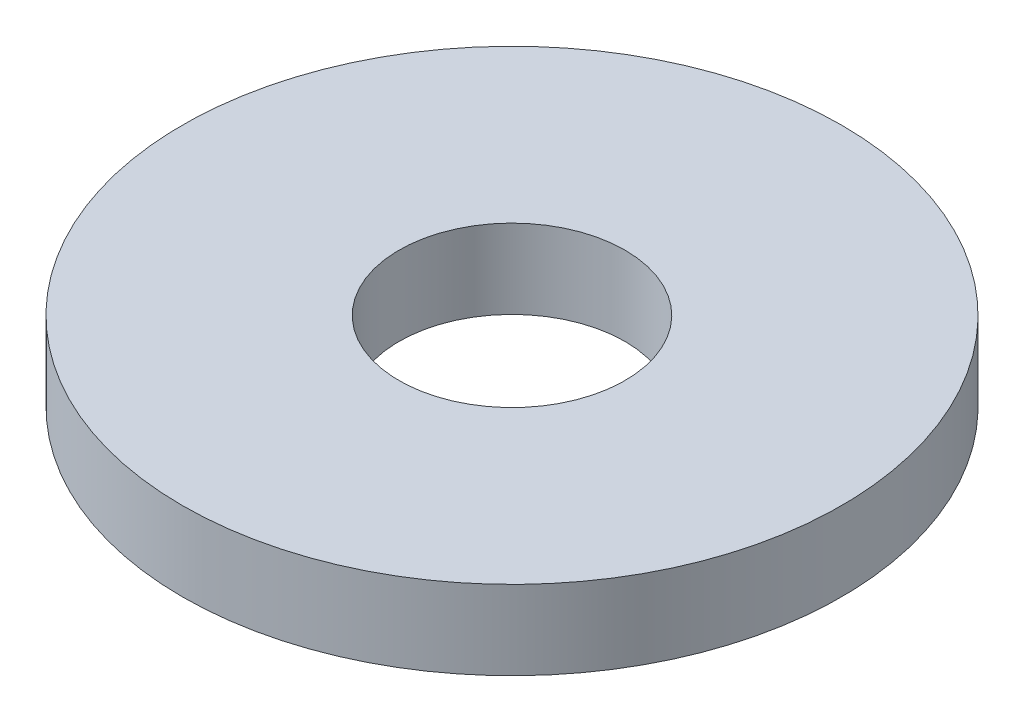
ISO-10303-21;
HEADER;
FILE_DESCRIPTION(('STEP AP214'),'2;1');
FILE_NAME('part.step','',(''),(''),'','','');
FILE_SCHEMA(('AUTOMOTIVE_DESIGN { 1 0 10303 214 1 1 1 1 }'));
ENDSEC;
DATA;
#1=APPLICATION_CONTEXT('core data for automotive mechanical design processes');
#2=APPLICATION_PROTOCOL_DEFINITION('international standard','automotive_design',2000,#1);
#3=PRODUCT_CONTEXT('',#1,'mechanical');
#4=PRODUCT('Part','Part','',(#3));
#5=PRODUCT_RELATED_PRODUCT_CATEGORY('part','',(#4));
#6=PRODUCT_DEFINITION_FORMATION('','',#4);
#7=PRODUCT_DEFINITION_CONTEXT('part definition',#1,'design');
#8=PRODUCT_DEFINITION('design','',#6,#7);
#9=PRODUCT_DEFINITION_SHAPE('','',#8);
#10=(LENGTH_UNIT() NAMED_UNIT(*) SI_UNIT(.MILLI.,.METRE.));
#11=(NAMED_UNIT(*) PLANE_ANGLE_UNIT() SI_UNIT($,.RADIAN.));
#12=(NAMED_UNIT(*) SI_UNIT($,.STERADIAN.) SOLID_ANGLE_UNIT());
#13=UNCERTAINTY_MEASURE_WITH_UNIT(LENGTH_MEASURE(1.E-05),#10,'distance_accuracy_value','');
#14=(GEOMETRIC_REPRESENTATION_CONTEXT(3) GLOBAL_UNCERTAINTY_ASSIGNED_CONTEXT((#13)) GLOBAL_UNIT_ASSIGNED_CONTEXT((#10,
#11,#12)) REPRESENTATION_CONTEXT('',''));
#15=CARTESIAN_POINT('',(0.,0.,0.));
#16=DIRECTION('',(0.,0.,1.));
#17=DIRECTION('',(1.,0.,0.));
#18=AXIS2_PLACEMENT_3D('',#15,#16,#17);
#19=CARTESIAN_POINT('',(0.,21.,0.));
#20=DIRECTION('',(0.,-1.,0.));
#21=DIRECTION('',(0.,0.,-1.));
#22=AXIS2_PLACEMENT_3D('',#19,#20,#21);
#23=CYLINDRICAL_SURFACE('',#22,87.5);
#24=CARTESIAN_POINT('',(0.,21.,0.));
#25=DIRECTION('',(0.,1.,0.));
#26=DIRECTION('',(0.,0.,1.));
#27=AXIS2_PLACEMENT_3D('',#24,#25,#26);
#28=CIRCLE('',#27,87.5);
#29=CARTESIAN_POINT('',(0.,21.,-87.5));
#30=VERTEX_POINT('',#29);
#31=EDGE_CURVE('E10',#30,#30,#28,.T.);
#32=CARTESIAN_POINT('',(0.,0.,0.));
#33=DIRECTION('',(0.,1.,0.));
#34=DIRECTION('',(0.,0.,1.));
#35=AXIS2_PLACEMENT_3D('',#32,#33,#34);
#36=CIRCLE('',#35,87.5);
#37=CARTESIAN_POINT('',(0.,0.,-87.5));
#38=VERTEX_POINT('',#37);
#39=EDGE_CURVE('E37',#38,#38,#36,.T.);
#40=CARTESIAN_POINT('',(0.,21.,-87.5));
#41=CARTESIAN_POINT('',(0.,20.78125,-87.5));
#42=CARTESIAN_POINT('',(0.,20.5625,-87.5));
#43=CARTESIAN_POINT('',(0.,20.125,-87.5));
#44=CARTESIAN_POINT('',(0.,19.90625,-87.5));
#45=CARTESIAN_POINT('',(0.,19.46875,-87.5));
#46=CARTESIAN_POINT('',(0.,19.25,-87.5));
#47=CARTESIAN_POINT('',(0.,18.8125,-87.5));
#48=CARTESIAN_POINT('',(0.,18.59375,-87.5));
#49=CARTESIAN_POINT('',(0.,18.15625,-87.5));
#50=CARTESIAN_POINT('',(0.,17.9375,-87.5));
#51=CARTESIAN_POINT('',(0.,17.5,-87.5));
#52=CARTESIAN_POINT('',(0.,17.28125,-87.5));
#53=CARTESIAN_POINT('',(0.,16.84375,-87.5));
#54=CARTESIAN_POINT('',(0.,16.625,-87.5));
#55=CARTESIAN_POINT('',(0.,16.1875,-87.5));
#56=CARTESIAN_POINT('',(0.,15.96875,-87.5));
#57=CARTESIAN_POINT('',(0.,15.53125,-87.5));
#58=CARTESIAN_POINT('',(0.,15.3125,-87.5));
#59=CARTESIAN_POINT('',(0.,14.875,-87.5));
#60=CARTESIAN_POINT('',(0.,14.65625,-87.5));
#61=CARTESIAN_POINT('',(0.,14.21875,-87.5));
#62=CARTESIAN_POINT('',(0.,14.,-87.5));
#63=CARTESIAN_POINT('',(0.,13.5625,-87.5));
#64=CARTESIAN_POINT('',(0.,13.34375,-87.5));
#65=CARTESIAN_POINT('',(0.,12.90625,-87.5));
#66=CARTESIAN_POINT('',(0.,12.6875,-87.5));
#67=CARTESIAN_POINT('',(0.,12.25,-87.5));
#68=CARTESIAN_POINT('',(0.,12.03125,-87.5));
#69=CARTESIAN_POINT('',(0.,11.59375,-87.5));
#70=CARTESIAN_POINT('',(0.,11.375,-87.5));
#71=CARTESIAN_POINT('',(0.,10.9375,-87.5));
#72=CARTESIAN_POINT('',(0.,10.71875,-87.5));
#73=CARTESIAN_POINT('',(0.,10.28125,-87.5));
#74=CARTESIAN_POINT('',(0.,10.0625,-87.5));
#75=CARTESIAN_POINT('',(0.,9.625,-87.5));
#76=CARTESIAN_POINT('',(0.,9.40625,-87.5));
#77=CARTESIAN_POINT('',(0.,8.96875,-87.5));
#78=CARTESIAN_POINT('',(0.,8.75,-87.5));
#79=CARTESIAN_POINT('',(0.,8.3125,-87.5));
#80=CARTESIAN_POINT('',(0.,8.09375,-87.5));
#81=CARTESIAN_POINT('',(0.,7.65625,-87.5));
#82=CARTESIAN_POINT('',(0.,7.4375,-87.5));
#83=CARTESIAN_POINT('',(0.,7.,-87.5));
#84=CARTESIAN_POINT('',(0.,6.78125,-87.5));
#85=CARTESIAN_POINT('',(0.,6.34375,-87.5));
#86=CARTESIAN_POINT('',(0.,6.125,-87.5));
#87=CARTESIAN_POINT('',(0.,5.6875,-87.5));
#88=CARTESIAN_POINT('',(0.,5.46875,-87.5));
#89=CARTESIAN_POINT('',(0.,5.03125,-87.5));
#90=CARTESIAN_POINT('',(0.,4.8125,-87.5));
#91=CARTESIAN_POINT('',(0.,4.375,-87.5));
#92=CARTESIAN_POINT('',(0.,4.15625,-87.5));
#93=CARTESIAN_POINT('',(0.,3.71875,-87.5));
#94=CARTESIAN_POINT('',(0.,3.5,-87.5));
#95=CARTESIAN_POINT('',(0.,3.0625,-87.5));
#96=CARTESIAN_POINT('',(0.,2.84375,-87.5));
#97=CARTESIAN_POINT('',(0.,2.40625,-87.5));
#98=CARTESIAN_POINT('',(0.,2.1875,-87.5));
#99=CARTESIAN_POINT('',(0.,1.75,-87.5));
#100=CARTESIAN_POINT('',(0.,1.53125,-87.5));
#101=CARTESIAN_POINT('',(0.,1.09375,-87.5));
#102=CARTESIAN_POINT('',(0.,0.875000000000001,-87.5));
#103=CARTESIAN_POINT('',(0.,0.4375,-87.5));
#104=CARTESIAN_POINT('',(0.,0.21875,-87.5));
#105=CARTESIAN_POINT('',(0.,0.,-87.5));
#106=B_SPLINE_CURVE_WITH_KNOTS('',3,(#40,#41,#42,#43,#44,#45,#46,#47,#48,#49,#50,#51,#52,#53,
#54,#55,#56,#57,#58,#59,#60,#61,#62,#63,#64,#65,#66,#67,#68,#69,#70,#71,#72,#73,#74,#75,#76,#77,
#78,#79,#80,#81,#82,#83,#84,#85,#86,#87,#88,#89,#90,#91,#92,#93,#94,#95,#96,#97,#98,#99,#100,
#101,#102,#103,#104,#105),.UNSPECIFIED.,.F.,.F.,(4,2,2,2,2,2,2,2,2,2,2,2,2,2,2,2,2,2,2,2,2,2,2,
2,2,2,2,2,2,2,2,2,4),(0.,0.656250000000001,1.3125,1.96875,2.625,3.28125,3.9375,4.59375,5.25,
5.90625,6.5625,7.21875,7.875,8.53125,9.1875,9.84375,10.5,11.15625,11.8125,12.46875,13.125,
13.78125,14.4375,15.09375,15.75,16.40625,17.0625,17.71875,18.375,19.03125,19.6875,20.34375,21.),.UNSPECIFIED.);
#107=EDGE_CURVE('BSEAM40',#30,#38,#106,.T.);
#108=ORIENTED_EDGE('',*,*,#31,.F.);
#109=ORIENTED_EDGE('',*,*,#39,.T.);
#110=ORIENTED_EDGE('',*,*,#107,.T.);
#111=ORIENTED_EDGE('',*,*,#107,.F.);
#112=EDGE_LOOP('',(#108,#110,#109,#111));
#113=FACE_BOUND('',#112,.T.);
#114=ADVANCED_FACE('F40',(#113),#23,.T.);
#115=CARTESIAN_POINT('',(0.,21.,0.));
#116=DIRECTION('',(0.,1.,0.));
#117=DIRECTION('',(0.,0.,1.));
#118=AXIS2_PLACEMENT_3D('',#115,#116,#117);
#119=PLANE('',#118);
#120=CARTESIAN_POINT('',(0.,21.,0.));
#121=DIRECTION('',(0.,1.,0.));
#122=DIRECTION('',(0.,0.,1.));
#123=AXIS2_PLACEMENT_3D('',#120,#121,#122);
#124=CIRCLE('',#123,30.);
#125=CARTESIAN_POINT('',(0.,21.,-30.));
#126=VERTEX_POINT('',#125);
#127=EDGE_CURVE('E50',#126,#126,#124,.T.);
#128=ORIENTED_EDGE('',*,*,#127,.F.);
#129=EDGE_LOOP('',(#128));
#130=FACE_BOUND('',#129,.T.);
#131=ORIENTED_EDGE('',*,*,#31,.T.);
#132=EDGE_LOOP('',(#131));
#133=FACE_BOUND('',#132,.T.);
#134=ADVANCED_FACE('F59',(#130,#133),#119,.T.);
#135=CARTESIAN_POINT('',(0.,0.,0.));
#136=DIRECTION('',(0.,1.,0.));
#137=DIRECTION('',(0.,0.,1.));
#138=AXIS2_PLACEMENT_3D('',#135,#136,#137);
#139=PLANE('',#138);
#140=CARTESIAN_POINT('',(0.,0.,0.));
#141=DIRECTION('',(0.,1.,0.));
#142=DIRECTION('',(0.,0.,1.));
#143=AXIS2_PLACEMENT_3D('',#140,#141,#142);
#144=CIRCLE('',#143,30.);
#145=CARTESIAN_POINT('',(0.,0.,-30.));
#146=VERTEX_POINT('',#145);
#147=EDGE_CURVE('E47',#146,#146,#144,.T.);
#148=ORIENTED_EDGE('',*,*,#147,.T.);
#149=EDGE_LOOP('',(#148));
#150=FACE_BOUND('',#149,.T.);
#151=ORIENTED_EDGE('',*,*,#39,.F.);
#152=EDGE_LOOP('',(#151));
#153=FACE_BOUND('',#152,.T.);
#154=ADVANCED_FACE('F58',(#150,#153),#139,.F.);
#155=CARTESIAN_POINT('',(0.,21.,0.));
#156=DIRECTION('',(0.,-1.,0.));
#157=DIRECTION('',(0.,0.,-1.));
#158=AXIS2_PLACEMENT_3D('',#155,#156,#157);
#159=CYLINDRICAL_SURFACE('',#158,30.);
#160=CARTESIAN_POINT('',(0.,21.,-30.));
#161=CARTESIAN_POINT('',(0.,20.78125,-30.));
#162=CARTESIAN_POINT('',(0.,20.5625,-30.));
#163=CARTESIAN_POINT('',(0.,20.125,-30.));
#164=CARTESIAN_POINT('',(0.,19.90625,-30.));
#165=CARTESIAN_POINT('',(0.,19.46875,-30.));
#166=CARTESIAN_POINT('',(0.,19.25,-30.));
#167=CARTESIAN_POINT('',(0.,18.8125,-30.));
#168=CARTESIAN_POINT('',(0.,18.59375,-30.));
#169=CARTESIAN_POINT('',(0.,18.15625,-30.));
#170=CARTESIAN_POINT('',(0.,17.9375,-30.));
#171=CARTESIAN_POINT('',(0.,17.5,-30.));
#172=CARTESIAN_POINT('',(0.,17.28125,-30.));
#173=CARTESIAN_POINT('',(0.,16.84375,-30.));
#174=CARTESIAN_POINT('',(0.,16.625,-30.));
#175=CARTESIAN_POINT('',(0.,16.1875,-30.));
#176=CARTESIAN_POINT('',(0.,15.96875,-30.));
#177=CARTESIAN_POINT('',(0.,15.53125,-30.));
#178=CARTESIAN_POINT('',(0.,15.3125,-30.));
#179=CARTESIAN_POINT('',(0.,14.875,-30.));
#180=CARTESIAN_POINT('',(0.,14.65625,-30.));
#181=CARTESIAN_POINT('',(0.,14.21875,-30.));
#182=CARTESIAN_POINT('',(0.,14.,-30.));
#183=CARTESIAN_POINT('',(0.,13.5625,-30.));
#184=CARTESIAN_POINT('',(0.,13.34375,-30.));
#185=CARTESIAN_POINT('',(0.,12.90625,-30.));
#186=CARTESIAN_POINT('',(0.,12.6875,-30.));
#187=CARTESIAN_POINT('',(0.,12.25,-30.));
#188=CARTESIAN_POINT('',(0.,12.03125,-30.));
#189=CARTESIAN_POINT('',(0.,11.59375,-30.));
#190=CARTESIAN_POINT('',(0.,11.375,-30.));
#191=CARTESIAN_POINT('',(0.,10.9375,-30.));
#192=CARTESIAN_POINT('',(0.,10.71875,-30.));
#193=CARTESIAN_POINT('',(0.,10.28125,-30.));
#194=CARTESIAN_POINT('',(0.,10.0625,-30.));
#195=CARTESIAN_POINT('',(0.,9.625,-30.));
#196=CARTESIAN_POINT('',(0.,9.40625,-30.));
#197=CARTESIAN_POINT('',(0.,8.96875,-30.));
#198=CARTESIAN_POINT('',(0.,8.75,-30.));
#199=CARTESIAN_POINT('',(0.,8.3125,-30.));
#200=CARTESIAN_POINT('',(0.,8.09375,-30.));
#201=CARTESIAN_POINT('',(0.,7.65625,-30.));
#202=CARTESIAN_POINT('',(0.,7.4375,-30.));
#203=CARTESIAN_POINT('',(0.,7.,-30.));
#204=CARTESIAN_POINT('',(0.,6.78125,-30.));
#205=CARTESIAN_POINT('',(0.,6.34375,-30.));
#206=CARTESIAN_POINT('',(0.,6.125,-30.));
#207=CARTESIAN_POINT('',(0.,5.6875,-30.));
#208=CARTESIAN_POINT('',(0.,5.46875,-30.));
#209=CARTESIAN_POINT('',(0.,5.03125,-30.));
#210=CARTESIAN_POINT('',(0.,4.8125,-30.));
#211=CARTESIAN_POINT('',(0.,4.375,-30.));
#212=CARTESIAN_POINT('',(0.,4.15625,-30.));
#213=CARTESIAN_POINT('',(0.,3.71875,-30.));
#214=CARTESIAN_POINT('',(0.,3.5,-30.));
#215=CARTESIAN_POINT('',(0.,3.0625,-30.));
#216=CARTESIAN_POINT('',(0.,2.84375,-30.));
#217=CARTESIAN_POINT('',(0.,2.40625,-30.));
#218=CARTESIAN_POINT('',(0.,2.1875,-30.));
#219=CARTESIAN_POINT('',(0.,1.75,-30.));
#220=CARTESIAN_POINT('',(0.,1.53125,-30.));
#221=CARTESIAN_POINT('',(0.,1.09375,-30.));
#222=CARTESIAN_POINT('',(0.,0.875000000000001,-30.));
#223=CARTESIAN_POINT('',(0.,0.4375,-30.));
#224=CARTESIAN_POINT('',(0.,0.21875,-30.));
#225=CARTESIAN_POINT('',(0.,0.,-30.));
#226=B_SPLINE_CURVE_WITH_KNOTS('',3,(#160,#161,#162,#163,#164,#165,#166,#167,#168,#169,#170,
#171,#172,#173,#174,#175,#176,#177,#178,#179,#180,#181,#182,#183,#184,#185,#186,#187,#188,#189,
#190,#191,#192,#193,#194,#195,#196,#197,#198,#199,#200,#201,#202,#203,#204,#205,#206,#207,#208,
#209,#210,#211,#212,#213,#214,#215,#216,#217,#218,#219,#220,#221,#222,#223,#224,#225),
.UNSPECIFIED.,.F.,.F.,(4,2,2,2,2,2,2,2,2,2,2,2,2,2,2,2,2,2,2,2,2,2,2,2,2,2,2,2,2,2,2,2,4),(0.,
0.656249999999997,1.3125,1.96875,2.625,3.28125,3.9375,4.59375,5.25,5.90625,6.5625,7.21875,7.875,
8.53125,9.1875,9.84375,10.5,11.15625,11.8125,12.46875,13.125,13.78125,14.4375,15.09375,15.75,
16.40625,17.0625,17.71875,18.375,19.03125,19.6875,20.34375,21.),.UNSPECIFIED.);
#227=EDGE_CURVE('BSEAM54',#126,#146,#226,.T.);
#228=ORIENTED_EDGE('',*,*,#127,.T.);
#229=ORIENTED_EDGE('',*,*,#147,.F.);
#230=ORIENTED_EDGE('',*,*,#227,.T.);
#231=ORIENTED_EDGE('',*,*,#227,.F.);
#232=EDGE_LOOP('',(#228,#230,#229,#231));
#233=FACE_BOUND('',#232,.T.);
#234=ADVANCED_FACE('F54',(#233),#159,.F.);
#235=CLOSED_SHELL('',(#114,#134,#154,#234));
#236=MANIFOLD_SOLID_BREP('B2',#235);
#237=ADVANCED_BREP_SHAPE_REPRESENTATION('',(#18,#236),#14);
#238=SHAPE_DEFINITION_REPRESENTATION(#9,#237);
ENDSEC;
END-ISO-10303-21;
